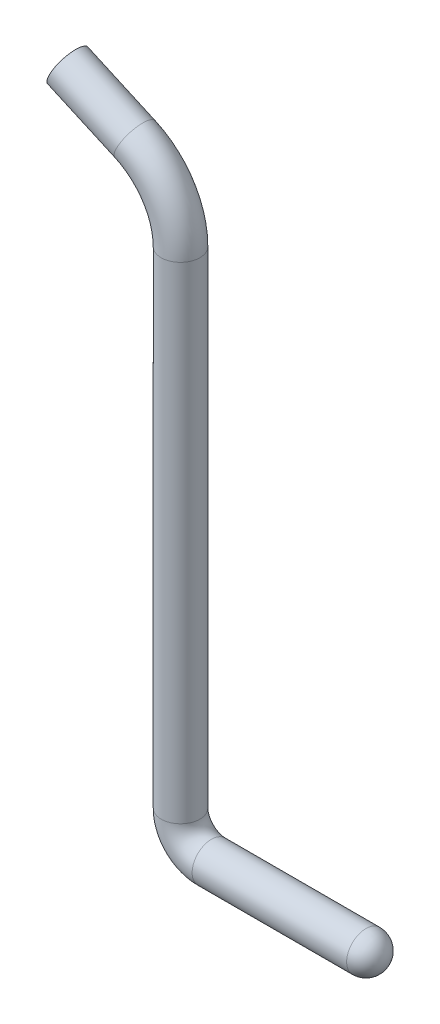
ISO-10303-21;
HEADER;
FILE_DESCRIPTION(('STEP AP214'),'2;1');
FILE_NAME('part.step','',(''),(''),'','','');
FILE_SCHEMA(('AUTOMOTIVE_DESIGN { 1 0 10303 214 1 1 1 1 }'));
ENDSEC;
DATA;
#1=APPLICATION_CONTEXT('core data for automotive mechanical design processes');
#2=APPLICATION_PROTOCOL_DEFINITION('international standard','automotive_design',2000,#1);
#3=PRODUCT_CONTEXT('',#1,'mechanical');
#4=PRODUCT('Part','Part','',(#3));
#5=PRODUCT_RELATED_PRODUCT_CATEGORY('part','',(#4));
#6=PRODUCT_DEFINITION_FORMATION('','',#4);
#7=PRODUCT_DEFINITION_CONTEXT('part definition',#1,'design');
#8=PRODUCT_DEFINITION('design','',#6,#7);
#9=PRODUCT_DEFINITION_SHAPE('','',#8);
#10=(LENGTH_UNIT() NAMED_UNIT(*) SI_UNIT(.MILLI.,.METRE.));
#11=(NAMED_UNIT(*) PLANE_ANGLE_UNIT() SI_UNIT($,.RADIAN.));
#12=(NAMED_UNIT(*) SI_UNIT($,.STERADIAN.) SOLID_ANGLE_UNIT());
#13=UNCERTAINTY_MEASURE_WITH_UNIT(LENGTH_MEASURE(1.E-05),#10,'distance_accuracy_value','');
#14=(GEOMETRIC_REPRESENTATION_CONTEXT(3) GLOBAL_UNCERTAINTY_ASSIGNED_CONTEXT((#13)) GLOBAL_UNIT_ASSIGNED_CONTEXT((#10,
#11,#12)) REPRESENTATION_CONTEXT('',''));
#15=CARTESIAN_POINT('',(0.,0.,0.));
#16=DIRECTION('',(0.,0.,1.));
#17=DIRECTION('',(1.,0.,0.));
#18=AXIS2_PLACEMENT_3D('',#15,#16,#17);
#19=CARTESIAN_POINT('',(-73.0116658235895,379.736275327625,0.));
#20=DIRECTION('',(0.912691587403504,-0.408649074736345,0.));
#21=DIRECTION('',(0.408649074736345,0.912691587403505,0.));
#22=AXIS2_PLACEMENT_3D('',#19,#20,#21);
#23=PLANE('',#22);
#24=CARTESIAN_POINT('',(-73.0116658235895,379.736275327625,0.));
#25=DIRECTION('',(0.912691587403504,-0.408649074736345,0.));
#26=DIRECTION('',(0.408649074736345,0.912691587403505,0.));
#27=AXIS2_PLACEMENT_3D('',#24,#25,#26);
#28=CIRCLE('',#27,12.5);
#29=CARTESIAN_POINT('',(-67.9035523893852,391.144920170169,0.));
#30=VERTEX_POINT('',#29);
#31=EDGE_CURVE('E11',#30,#30,#28,.T.);
#32=ORIENTED_EDGE('',*,*,#31,.F.);
#33=EDGE_LOOP('',(#32));
#34=FACE_BOUND('',#33,.T.);
#35=ADVANCED_FACE('F49',(#34),#23,.F.);
#36=CARTESIAN_POINT('',(120.,-19.9999999999999,0.));
#37=DIRECTION('',(-1.,0.,0.));
#38=DIRECTION('',(0.,0.,1.));
#39=AXIS2_PLACEMENT_3D('',#36,#37,#38);
#40=CYLINDRICAL_SURFACE('',#39,12.5);
#41=CARTESIAN_POINT('',(19.9999999999999,-19.9999999999999,0.));
#42=DIRECTION('',(1.,0.,0.));
#43=DIRECTION('',(0.,1.,0.));
#44=AXIS2_PLACEMENT_3D('',#41,#42,#43);
#45=CIRCLE('',#44,12.5);
#46=CARTESIAN_POINT('',(19.9999999999998,-32.4999999999999,0.));
#47=VERTEX_POINT('',#46);
#48=EDGE_CURVE('E72',#47,#47,#45,.T.);
#49=ORIENTED_EDGE('',*,*,#48,.T.);
#50=EDGE_LOOP('',(#49));
#51=FACE_BOUND('',#50,.T.);
#52=CARTESIAN_POINT('',(120.,-19.9999999999999,0.));
#53=DIRECTION('',(1.,0.,0.));
#54=DIRECTION('',(0.,1.,0.));
#55=AXIS2_PLACEMENT_3D('',#52,#53,#54);
#56=CIRCLE('',#55,12.5);
#57=CARTESIAN_POINT('',(120.,-7.4999999999999,0.));
#58=VERTEX_POINT('',#57);
#59=EDGE_CURVE('E76',#58,#58,#56,.T.);
#60=ORIENTED_EDGE('',*,*,#59,.F.);
#61=EDGE_LOOP('',(#60));
#62=FACE_BOUND('',#61,.T.);
#63=ADVANCED_FACE('F83',(#51,#62),#40,.T.);
#64=CARTESIAN_POINT('',(20.,0.,0.));
#65=DIRECTION('',(0.,0.,-1.));
#66=DIRECTION('',(-1.,0.,0.));
#67=AXIS2_PLACEMENT_3D('',#64,#65,#66);
#68=TOROIDAL_SURFACE('',#67,19.9999999999999,12.5);
#69=CARTESIAN_POINT('',(0.,1.38777878078145E-13,0.));
#70=DIRECTION('',(0.,-1.,0.));
#71=DIRECTION('',(1.,0.,0.));
#72=AXIS2_PLACEMENT_3D('',#69,#70,#71);
#73=CIRCLE('',#72,12.5);
#74=CARTESIAN_POINT('',(-12.4999999999999,2.25514051876985E-13,0.));
#75=VERTEX_POINT('',#74);
#76=EDGE_CURVE('E66',#75,#75,#73,.T.);
#77=CARTESIAN_POINT('',(20.,0.,0.));
#78=DIRECTION('',(0.,0.,-1.));
#79=DIRECTION('',(-1.,0.,0.));
#80=AXIS2_PLACEMENT_3D('',#77,#78,#79);
#81=CIRCLE('',#80,32.4999999999999);
#82=EDGE_CURVE('',#47,#75,#81,.T.);
#83=ORIENTED_EDGE('',*,*,#48,.F.);
#84=ORIENTED_EDGE('',*,*,#76,.T.);
#85=ORIENTED_EDGE('',*,*,#82,.T.);
#86=ORIENTED_EDGE('',*,*,#82,.F.);
#87=EDGE_LOOP('',(#83,#85,#84,#86));
#88=FACE_BOUND('',#87,.T.);
#89=ADVANCED_FACE('F85',(#88),#68,.T.);
#90=CARTESIAN_POINT('',(1.11022302462516E-13,1.11022302462516E-13,0.));
#91=DIRECTION('',(0.,1.,0.));
#92=DIRECTION('',(0.,0.,1.));
#93=AXIS2_PLACEMENT_3D('',#90,#91,#92);
#94=CYLINDRICAL_SURFACE('',#93,12.5);
#95=CARTESIAN_POINT('',(1.11022302462516E-13,314.65,0.));
#96=DIRECTION('',(0.,-1.,0.));
#97=DIRECTION('',(1.,0.,0.));
#98=AXIS2_PLACEMENT_3D('',#95,#96,#97);
#99=CIRCLE('',#98,12.5);
#100=CARTESIAN_POINT('',(12.5000000000001,314.65,0.));
#101=VERTEX_POINT('',#100);
#102=EDGE_CURVE('E61',#101,#101,#99,.T.);
#103=ORIENTED_EDGE('',*,*,#102,.T.);
#104=EDGE_LOOP('',(#103));
#105=FACE_BOUND('',#104,.T.);
#106=ORIENTED_EDGE('',*,*,#76,.F.);
#107=EDGE_LOOP('',(#106));
#108=FACE_BOUND('',#107,.T.);
#109=ADVANCED_FACE('F92',(#105,#108),#94,.T.);
#110=CARTESIAN_POINT('',(-50.,314.65,0.));
#111=DIRECTION('',(0.,0.,1.));
#112=DIRECTION('',(1.,0.,0.));
#113=AXIS2_PLACEMENT_3D('',#110,#111,#112);
#114=TOROIDAL_SURFACE('',#113,50.0000000000001,12.5);
#115=CARTESIAN_POINT('',(-29.567546263183,360.284579370175,0.));
#116=DIRECTION('',(0.912691587403504,-0.408649074736345,0.));
#117=DIRECTION('',(0.408649074736345,0.912691587403505,0.));
#118=AXIS2_PLACEMENT_3D('',#115,#116,#117);
#119=CIRCLE('',#118,12.5);
#120=CARTESIAN_POINT('',(-24.4594328289787,371.693224212719,0.));
#121=VERTEX_POINT('',#120);
#122=EDGE_CURVE('E56',#121,#121,#119,.T.);
#123=CARTESIAN_POINT('',(-50.,314.65,0.));
#124=DIRECTION('',(0.,0.,1.));
#125=DIRECTION('',(1.,0.,0.));
#126=AXIS2_PLACEMENT_3D('',#123,#124,#125);
#127=CIRCLE('',#126,62.5000000000001);
#128=EDGE_CURVE('',#101,#121,#127,.T.);
#129=ORIENTED_EDGE('',*,*,#102,.F.);
#130=ORIENTED_EDGE('',*,*,#122,.T.);
#131=ORIENTED_EDGE('',*,*,#128,.T.);
#132=ORIENTED_EDGE('',*,*,#128,.F.);
#133=EDGE_LOOP('',(#129,#131,#130,#132));
#134=FACE_BOUND('',#133,.T.);
#135=ADVANCED_FACE('F99',(#134),#114,.T.);
#136=CARTESIAN_POINT('',(-29.5675462631828,360.284579370175,0.));
#137=DIRECTION('',(-0.912691587403504,0.408649074736346,0.));
#138=DIRECTION('',(-0.408649074736346,-0.912691587403504,0.));
#139=AXIS2_PLACEMENT_3D('',#136,#137,#138);
#140=CYLINDRICAL_SURFACE('',#139,12.5);
#141=ORIENTED_EDGE('',*,*,#31,.T.);
#142=EDGE_LOOP('',(#141));
#143=FACE_BOUND('',#142,.T.);
#144=ORIENTED_EDGE('',*,*,#122,.F.);
#145=EDGE_LOOP('',(#144));
#146=FACE_BOUND('',#145,.T.);
#147=ADVANCED_FACE('F97',(#143,#146),#140,.T.);
#148=CARTESIAN_POINT('',(120.,-20.,0.));
#149=DIRECTION('',(0.,1.,0.));
#150=DIRECTION('',(1.,0.,0.));
#151=AXIS2_PLACEMENT_3D('',#148,#149,#150);
#152=SPHERICAL_SURFACE('',#151,12.5);
#153=CARTESIAN_POINT('',(120.,-20.,0.));
#154=DIRECTION('',(1.,0.,0.));
#155=DIRECTION('',(0.,1.,0.));
#156=AXIS2_PLACEMENT_3D('',#153,#154,#155);
#157=SPHERICAL_SURFACE('',#156,12.5);
#158=ORIENTED_EDGE('',*,*,#59,.T.);
#159=EDGE_LOOP('',(#158));
#160=FACE_BOUND('',#159,.T.);
#161=ADVANCED_FACE('F81',(#160),#157,.T.);
#162=CLOSED_SHELL('',(#35,#63,#89,#109,#135,#147,#161));
#163=MANIFOLD_SOLID_BREP('B2',#162);
#164=ADVANCED_BREP_SHAPE_REPRESENTATION('',(#18,#163),#14);
#165=SHAPE_DEFINITION_REPRESENTATION(#9,#164);
ENDSEC;
END-ISO-10303-21;
